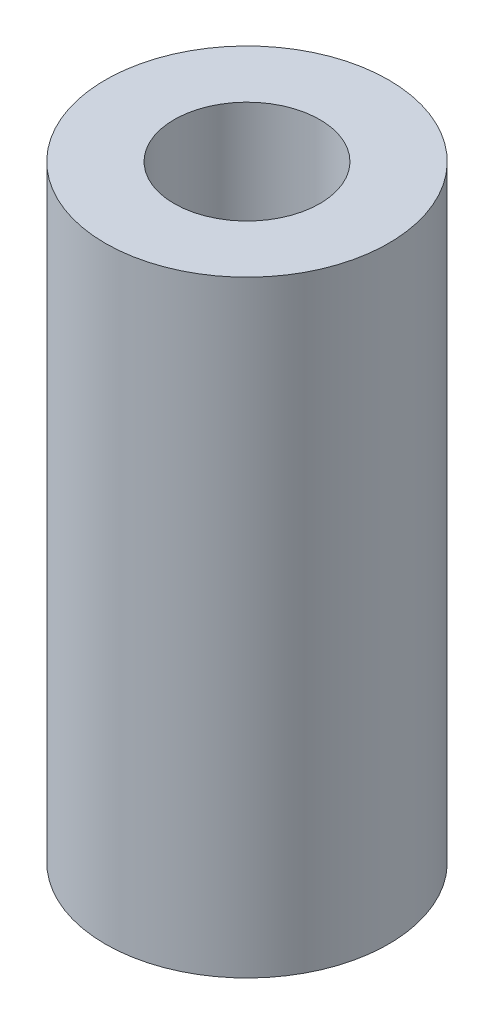
ISO-10303-21;
HEADER;
FILE_DESCRIPTION(('STEP AP214'),'2;1');
FILE_NAME('part.step','',(''),(''),'','','');
FILE_SCHEMA(('AUTOMOTIVE_DESIGN { 1 0 10303 214 1 1 1 1 }'));
ENDSEC;
DATA;
#1=APPLICATION_CONTEXT('core data for automotive mechanical design processes');
#2=APPLICATION_PROTOCOL_DEFINITION('international standard','automotive_design',2000,#1);
#3=PRODUCT_CONTEXT('',#1,'mechanical');
#4=PRODUCT('Part','Part','',(#3));
#5=PRODUCT_RELATED_PRODUCT_CATEGORY('part','',(#4));
#6=PRODUCT_DEFINITION_FORMATION('','',#4);
#7=PRODUCT_DEFINITION_CONTEXT('part definition',#1,'design');
#8=PRODUCT_DEFINITION('design','',#6,#7);
#9=PRODUCT_DEFINITION_SHAPE('','',#8);
#10=(LENGTH_UNIT() NAMED_UNIT(*) SI_UNIT(.MILLI.,.METRE.));
#11=(NAMED_UNIT(*) PLANE_ANGLE_UNIT() SI_UNIT($,.RADIAN.));
#12=(NAMED_UNIT(*) SI_UNIT($,.STERADIAN.) SOLID_ANGLE_UNIT());
#13=UNCERTAINTY_MEASURE_WITH_UNIT(LENGTH_MEASURE(1.E-05),#10,'distance_accuracy_value','');
#14=(GEOMETRIC_REPRESENTATION_CONTEXT(3) GLOBAL_UNCERTAINTY_ASSIGNED_CONTEXT((#13)) GLOBAL_UNIT_ASSIGNED_CONTEXT((#10,
#11,#12)) REPRESENTATION_CONTEXT('',''));
#15=CARTESIAN_POINT('',(0.,0.,0.));
#16=DIRECTION('',(0.,0.,1.));
#17=DIRECTION('',(1.,0.,0.));
#18=AXIS2_PLACEMENT_3D('',#15,#16,#17);
#19=CARTESIAN_POINT('',(0.,7.5,0.));
#20=DIRECTION('',(0.,1.,0.));
#21=DIRECTION('',(0.,0.,1.));
#22=AXIS2_PLACEMENT_3D('',#19,#20,#21);
#23=PLANE('',#22);
#24=CARTESIAN_POINT('',(0.,7.5,0.));
#25=DIRECTION('',(0.,1.,0.));
#26=DIRECTION('',(0.,0.,1.));
#27=AXIS2_PLACEMENT_3D('',#24,#25,#26);
#28=CIRCLE('',#27,3.5);
#29=CARTESIAN_POINT('',(0.,7.5,3.5));
#30=VERTEX_POINT('',#29);
#31=EDGE_CURVE('E10',#30,#30,#28,.T.);
#32=ORIENTED_EDGE('',*,*,#31,.T.);
#33=EDGE_LOOP('',(#32));
#34=FACE_BOUND('',#33,.T.);
#35=CARTESIAN_POINT('',(0.,7.5,0.));
#36=DIRECTION('',(0.,1.,0.));
#37=DIRECTION('',(0.,0.,1.));
#38=AXIS2_PLACEMENT_3D('',#35,#36,#37);
#39=CIRCLE('',#38,1.8);
#40=CARTESIAN_POINT('',(0.,7.5,1.8));
#41=VERTEX_POINT('',#40);
#42=EDGE_CURVE('E48',#41,#41,#39,.T.);
#43=ORIENTED_EDGE('',*,*,#42,.F.);
#44=EDGE_LOOP('',(#43));
#45=FACE_BOUND('',#44,.T.);
#46=ADVANCED_FACE('F37',(#34,#45),#23,.T.);
#47=CARTESIAN_POINT('',(0.,-7.5,0.));
#48=DIRECTION('',(0.,1.,0.));
#49=DIRECTION('',(0.,0.,1.));
#50=AXIS2_PLACEMENT_3D('',#47,#48,#49);
#51=PLANE('',#50);
#52=CARTESIAN_POINT('',(0.,-7.5,0.));
#53=DIRECTION('',(0.,1.,0.));
#54=DIRECTION('',(0.,0.,1.));
#55=AXIS2_PLACEMENT_3D('',#52,#53,#54);
#56=CIRCLE('',#55,3.5);
#57=CARTESIAN_POINT('',(0.,-7.5,3.5));
#58=VERTEX_POINT('',#57);
#59=EDGE_CURVE('E41',#58,#58,#56,.T.);
#60=ORIENTED_EDGE('',*,*,#59,.F.);
#61=EDGE_LOOP('',(#60));
#62=FACE_BOUND('',#61,.T.);
#63=CARTESIAN_POINT('',(0.,-7.5,0.));
#64=DIRECTION('',(0.,1.,0.));
#65=DIRECTION('',(0.,0.,1.));
#66=AXIS2_PLACEMENT_3D('',#63,#64,#65);
#67=CIRCLE('',#66,1.8);
#68=CARTESIAN_POINT('',(0.,-7.5,1.8));
#69=VERTEX_POINT('',#68);
#70=EDGE_CURVE('E50',#69,#69,#67,.T.);
#71=ORIENTED_EDGE('',*,*,#70,.T.);
#72=EDGE_LOOP('',(#71));
#73=FACE_BOUND('',#72,.T.);
#74=ADVANCED_FACE('F60',(#62,#73),#51,.F.);
#75=CARTESIAN_POINT('',(0.,7.5,0.));
#76=DIRECTION('',(0.,-1.,0.));
#77=DIRECTION('',(0.,0.,-1.));
#78=AXIS2_PLACEMENT_3D('',#75,#76,#77);
#79=CYLINDRICAL_SURFACE('',#78,3.5);
#80=ORIENTED_EDGE('',*,*,#31,.F.);
#81=EDGE_LOOP('',(#80));
#82=FACE_BOUND('',#81,.T.);
#83=ORIENTED_EDGE('',*,*,#59,.T.);
#84=EDGE_LOOP('',(#83));
#85=FACE_BOUND('',#84,.T.);
#86=ADVANCED_FACE('F39',(#82,#85),#79,.T.);
#87=CARTESIAN_POINT('',(0.,7.5,0.));
#88=DIRECTION('',(0.,-1.,0.));
#89=DIRECTION('',(0.,0.,-1.));
#90=AXIS2_PLACEMENT_3D('',#87,#88,#89);
#91=CYLINDRICAL_SURFACE('',#90,1.8);
#92=ORIENTED_EDGE('',*,*,#42,.T.);
#93=EDGE_LOOP('',(#92));
#94=FACE_BOUND('',#93,.T.);
#95=ORIENTED_EDGE('',*,*,#70,.F.);
#96=EDGE_LOOP('',(#95));
#97=FACE_BOUND('',#96,.T.);
#98=ADVANCED_FACE('F56',(#94,#97),#91,.F.);
#99=CLOSED_SHELL('',(#46,#74,#86,#98));
#100=MANIFOLD_SOLID_BREP('B2',#99);
#101=ADVANCED_BREP_SHAPE_REPRESENTATION('',(#18,#100),#14);
#102=SHAPE_DEFINITION_REPRESENTATION(#9,#101);
ENDSEC;
END-ISO-10303-21;
